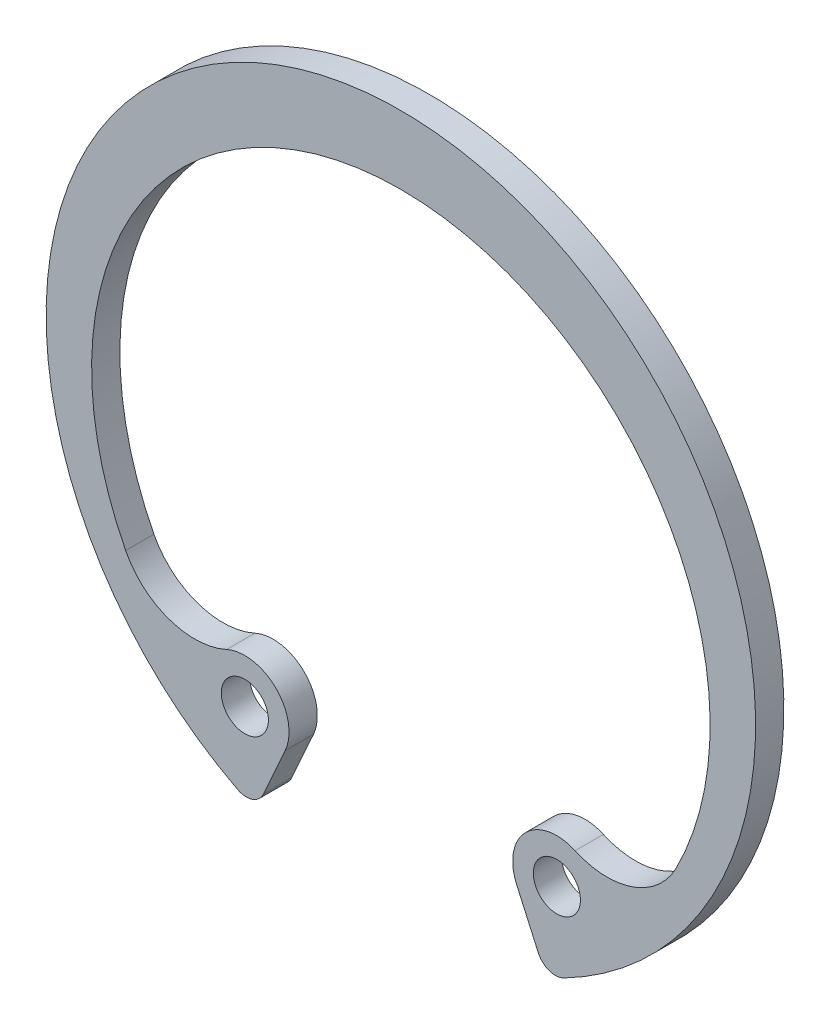
ISO-10303-21;
HEADER;
FILE_DESCRIPTION(('STEP AP214'),'2;1');
FILE_NAME('part.step','',(''),(''),'','','');
FILE_SCHEMA(('AUTOMOTIVE_DESIGN { 1 0 10303 214 1 1 1 1 }'));
ENDSEC;
DATA;
#1=APPLICATION_CONTEXT('core data for automotive mechanical design processes');
#2=APPLICATION_PROTOCOL_DEFINITION('international standard','automotive_design',2000,#1);
#3=PRODUCT_CONTEXT('',#1,'mechanical');
#4=PRODUCT('Part','Part','',(#3));
#5=PRODUCT_RELATED_PRODUCT_CATEGORY('part','',(#4));
#6=PRODUCT_DEFINITION_FORMATION('','',#4);
#7=PRODUCT_DEFINITION_CONTEXT('part definition',#1,'design');
#8=PRODUCT_DEFINITION('design','',#6,#7);
#9=PRODUCT_DEFINITION_SHAPE('','',#8);
#10=(LENGTH_UNIT() NAMED_UNIT(*) SI_UNIT(.MILLI.,.METRE.));
#11=(NAMED_UNIT(*) PLANE_ANGLE_UNIT() SI_UNIT($,.RADIAN.));
#12=(NAMED_UNIT(*) SI_UNIT($,.STERADIAN.) SOLID_ANGLE_UNIT());
#13=UNCERTAINTY_MEASURE_WITH_UNIT(LENGTH_MEASURE(1.E-05),#10,'distance_accuracy_value','');
#14=(GEOMETRIC_REPRESENTATION_CONTEXT(3) GLOBAL_UNCERTAINTY_ASSIGNED_CONTEXT((#13)) GLOBAL_UNIT_ASSIGNED_CONTEXT((#10,
#11,#12)) REPRESENTATION_CONTEXT('',''));
#15=CARTESIAN_POINT('',(0.,0.,0.));
#16=DIRECTION('',(0.,0.,1.));
#17=DIRECTION('',(1.,0.,0.));
#18=AXIS2_PLACEMENT_3D('',#15,#16,#17);
#19=CARTESIAN_POINT('',(0.,0.,-0.600000000000003));
#20=DIRECTION('',(0.,0.,1.));
#21=DIRECTION('',(1.,0.,0.));
#22=AXIS2_PLACEMENT_3D('',#19,#20,#21);
#23=CYLINDRICAL_SURFACE('',#22,15.05);
#24=CARTESIAN_POINT('',(0.,0.,0.600000000000003));
#25=DIRECTION('',(0.,0.,1.));
#26=DIRECTION('',(-1.,0.,0.));
#27=AXIS2_PLACEMENT_3D('',#24,#25,#26);
#28=CIRCLE('',#27,15.05);
#29=CARTESIAN_POINT('',(6.921631693515,-13.3638884573065,0.600000000000003));
#30=VERTEX_POINT('',#29);
#31=CARTESIAN_POINT('',(-6.92163169351501,-13.3638884573065,0.600000000000003));
#32=VERTEX_POINT('',#31);
#33=EDGE_CURVE('E134',#30,#32,#28,.T.);
#34=ORIENTED_EDGE('',*,*,#33,.F.);
#35=DIRECTION('',(0.,0.,1.));
#36=VECTOR('',#35,1.);
#37=CARTESIAN_POINT('',(6.92163169351501,-13.3638884573065,-0.600000000000003));
#38=LINE('',#37,#36);
#39=CARTESIAN_POINT('',(6.921631693515,-13.3638884573065,-0.600000000000003));
#40=VERTEX_POINT('',#39);
#41=EDGE_CURVE('E233',#30,#40,#38,.F.);
#42=ORIENTED_EDGE('',*,*,#41,.T.);
#43=CARTESIAN_POINT('',(0.,0.,-0.600000000000003));
#44=DIRECTION('',(0.,0.,1.));
#45=DIRECTION('',(-1.,0.,0.));
#46=AXIS2_PLACEMENT_3D('',#43,#44,#45);
#47=CIRCLE('',#46,15.05);
#48=CARTESIAN_POINT('',(-6.92163169351501,-13.3638884573065,-0.600000000000003));
#49=VERTEX_POINT('',#48);
#50=EDGE_CURVE('E179',#40,#49,#47,.T.);
#51=ORIENTED_EDGE('',*,*,#50,.T.);
#52=DIRECTION('',(0.,0.,1.));
#53=VECTOR('',#52,1.);
#54=CARTESIAN_POINT('',(-6.92163169351501,-13.3638884573065,-0.600000000000003));
#55=LINE('',#54,#53);
#56=EDGE_CURVE('E229',#49,#32,#55,.T.);
#57=ORIENTED_EDGE('',*,*,#56,.T.);
#58=EDGE_LOOP('',(#34,#42,#51,#57));
#59=FACE_BOUND('',#58,.T.);
#60=ADVANCED_FACE('F45',(#59),#23,.T.);
#61=CARTESIAN_POINT('',(4.90852916224253,-10.9273208730875,-0.600000000000003));
#62=DIRECTION('',(-0.912195121951219,-0.409756097560976,0.));
#63=DIRECTION('',(0.409756097560976,-0.912195121951219,0.));
#64=AXIS2_PLACEMENT_3D('',#61,#62,#63);
#65=PLANE('',#64);
#66=DIRECTION('',(0.409756097560976,-0.912195121951219,0.));
#67=VECTOR('',#66,1.);
#68=CARTESIAN_POINT('',(4.90852916224253,-10.9273208730875,-0.600000000000003));
#69=LINE('',#68,#67);
#70=CARTESIAN_POINT('',(4.90852916224253,-10.9273208730875,-0.600000000000003));
#71=VERTEX_POINT('',#70);
#72=CARTESIAN_POINT('',(5.83252398113217,-12.984309338949,-0.600000000000003));
#73=VERTEX_POINT('',#72);
#74=EDGE_CURVE('E145',#71,#73,#69,.T.);
#75=ORIENTED_EDGE('',*,*,#74,.T.);
#76=DIRECTION('',(0.,0.,1.));
#77=VECTOR('',#76,1.);
#78=CARTESIAN_POINT('',(5.83252398113217,-12.984309338949,-0.600000000000003));
#79=LINE('',#78,#77);
#80=CARTESIAN_POINT('',(5.83252398113217,-12.984309338949,0.600000000000003));
#81=VERTEX_POINT('',#80);
#82=EDGE_CURVE('E209',#73,#81,#79,.T.);
#83=ORIENTED_EDGE('',*,*,#82,.T.);
#84=DIRECTION('',(0.409756097560976,-0.912195121951219,0.));
#85=VECTOR('',#84,1.);
#86=CARTESIAN_POINT('',(4.90852916224253,-10.9273208730875,0.600000000000003));
#87=LINE('',#86,#85);
#88=CARTESIAN_POINT('',(4.90852916224253,-10.9273208730875,0.600000000000003));
#89=VERTEX_POINT('',#88);
#90=EDGE_CURVE('E168',#89,#81,#87,.T.);
#91=ORIENTED_EDGE('',*,*,#90,.F.);
#92=DIRECTION('',(0.,0.,1.));
#93=VECTOR('',#92,1.);
#94=CARTESIAN_POINT('',(4.90852916224253,-10.9273208730875,-0.600000000000003));
#95=LINE('',#94,#93);
#96=EDGE_CURVE('E206',#71,#89,#95,.T.);
#97=ORIENTED_EDGE('',*,*,#96,.F.);
#98=EDGE_LOOP('',(#75,#83,#91,#97));
#99=FACE_BOUND('',#98,.T.);
#100=ADVANCED_FACE('F247',(#99),#65,.T.);
#101=CARTESIAN_POINT('',(6.61889501590107,-10.1590281901607,-0.600000000000003));
#102=DIRECTION('',(0.,0.,1.));
#103=DIRECTION('',(1.,0.,0.));
#104=AXIS2_PLACEMENT_3D('',#101,#102,#103);
#105=CYLINDRICAL_SURFACE('',#104,1.875);
#106=ORIENTED_EDGE('',*,*,#96,.T.);
#107=CARTESIAN_POINT('',(6.61889501590107,-10.1590281901607,0.600000000000003));
#108=DIRECTION('',(0.,0.,1.));
#109=DIRECTION('',(1.,0.,0.));
#110=AXIS2_PLACEMENT_3D('',#107,#108,#109);
#111=CIRCLE('',#110,1.875);
#112=CARTESIAN_POINT('',(7.39299739421459,-8.45128391542596,0.600000000000003));
#113=VERTEX_POINT('',#112);
#114=EDGE_CURVE('E164',#113,#89,#111,.T.);
#115=ORIENTED_EDGE('',*,*,#114,.F.);
#116=DIRECTION('',(0.,0.,1.));
#117=VECTOR('',#116,1.);
#118=CARTESIAN_POINT('',(7.39299739421459,-8.45128391542596,-0.600000000000003));
#119=LINE('',#118,#117);
#120=CARTESIAN_POINT('',(7.39299739421459,-8.45128391542596,-0.600000000000003));
#121=VERTEX_POINT('',#120);
#122=EDGE_CURVE('E210',#121,#113,#119,.T.);
#123=ORIENTED_EDGE('',*,*,#122,.F.);
#124=CARTESIAN_POINT('',(6.61889501590107,-10.1590281901607,-0.600000000000003));
#125=DIRECTION('',(0.,0.,1.));
#126=DIRECTION('',(1.,0.,0.));
#127=AXIS2_PLACEMENT_3D('',#124,#125,#126);
#128=CIRCLE('',#127,1.875);
#129=EDGE_CURVE('E199',#121,#71,#128,.T.);
#130=ORIENTED_EDGE('',*,*,#129,.T.);
#131=EDGE_LOOP('',(#106,#115,#123,#130));
#132=FACE_BOUND('',#131,.T.);
#133=ADVANCED_FACE('F282',(#132),#105,.T.);
#134=CARTESIAN_POINT('',(8.75028885540433,-5.45696845156832,-0.600000000000003));
#135=DIRECTION('',(0.,0.,1.));
#136=DIRECTION('',(1.,0.,0.));
#137=AXIS2_PLACEMENT_3D('',#134,#135,#136);
#138=CYLINDRICAL_SURFACE('',#137,3.28757740710627);
#139=ORIENTED_EDGE('',*,*,#122,.T.);
#140=CARTESIAN_POINT('',(8.75028885540433,-5.45696845156832,0.600000000000003));
#141=DIRECTION('',(0.,0.,-1.));
#142=DIRECTION('',(-1.,0.,0.));
#143=AXIS2_PLACEMENT_3D('',#140,#141,#142);
#144=CIRCLE('',#143,3.28757740710627);
#145=CARTESIAN_POINT('',(11.6757947051064,-6.9568286887487,0.600000000000003));
#146=VERTEX_POINT('',#145);
#147=EDGE_CURVE('E160',#146,#113,#144,.T.);
#148=ORIENTED_EDGE('',*,*,#147,.F.);
#149=DIRECTION('',(0.,0.,1.));
#150=VECTOR('',#149,1.);
#151=CARTESIAN_POINT('',(11.6757947051064,-6.9568286887487,-0.600000000000003));
#152=LINE('',#151,#150);
#153=CARTESIAN_POINT('',(11.6757947051064,-6.9568286887487,-0.600000000000003));
#154=VERTEX_POINT('',#153);
#155=EDGE_CURVE('E213',#154,#146,#152,.T.);
#156=ORIENTED_EDGE('',*,*,#155,.F.);
#157=CARTESIAN_POINT('',(8.75028885540433,-5.45696845156832,-0.600000000000003));
#158=DIRECTION('',(0.,0.,-1.));
#159=DIRECTION('',(-1.,0.,0.));
#160=AXIS2_PLACEMENT_3D('',#157,#158,#159);
#161=CIRCLE('',#160,3.28757740710627);
#162=EDGE_CURVE('E195',#154,#121,#161,.T.);
#163=ORIENTED_EDGE('',*,*,#162,.T.);
#164=EDGE_LOOP('',(#139,#148,#156,#163));
#165=FACE_BOUND('',#164,.T.);
#166=ADVANCED_FACE('F296',(#165),#138,.F.);
#167=CARTESIAN_POINT('',(0.,-0.970834773387413,-0.600000000000003));
#168=DIRECTION('',(0.,0.,1.));
#169=DIRECTION('',(1.,0.,0.));
#170=AXIS2_PLACEMENT_3D('',#167,#168,#169);
#171=CYLINDRICAL_SURFACE('',#170,13.1208347733874);
#172=ORIENTED_EDGE('',*,*,#155,.T.);
#173=CARTESIAN_POINT('',(0.,-0.970834773387413,0.600000000000003));
#174=DIRECTION('',(0.,0.,-1.));
#175=DIRECTION('',(-1.,0.,0.));
#176=AXIS2_PLACEMENT_3D('',#173,#174,#175);
#177=CIRCLE('',#176,13.1208347733874);
#178=CARTESIAN_POINT('',(-11.6757947051064,-6.9568286887487,0.600000000000003));
#179=VERTEX_POINT('',#178);
#180=EDGE_CURVE('E153',#179,#146,#177,.T.);
#181=ORIENTED_EDGE('',*,*,#180,.F.);
#182=DIRECTION('',(0.,0.,1.));
#183=VECTOR('',#182,1.);
#184=CARTESIAN_POINT('',(-11.6757947051064,-6.9568286887487,-0.600000000000003));
#185=LINE('',#184,#183);
#186=CARTESIAN_POINT('',(-11.6757947051064,-6.9568286887487,-0.600000000000003));
#187=VERTEX_POINT('',#186);
#188=EDGE_CURVE('E216',#187,#179,#185,.T.);
#189=ORIENTED_EDGE('',*,*,#188,.F.);
#190=CARTESIAN_POINT('',(0.,-0.970834773387413,-0.600000000000003));
#191=DIRECTION('',(0.,0.,-1.));
#192=DIRECTION('',(-1.,0.,0.));
#193=AXIS2_PLACEMENT_3D('',#190,#191,#192);
#194=CIRCLE('',#193,13.1208347733874);
#195=EDGE_CURVE('E191',#187,#154,#194,.T.);
#196=ORIENTED_EDGE('',*,*,#195,.T.);
#197=EDGE_LOOP('',(#172,#181,#189,#196));
#198=FACE_BOUND('',#197,.T.);
#199=ADVANCED_FACE('F292',(#198),#171,.F.);
#200=CARTESIAN_POINT('',(-8.75028885540433,-5.45696845156832,-0.600000000000003));
#201=DIRECTION('',(0.,0.,1.));
#202=DIRECTION('',(1.,0.,0.));
#203=AXIS2_PLACEMENT_3D('',#200,#201,#202);
#204=CYLINDRICAL_SURFACE('',#203,3.28757740710627);
#205=ORIENTED_EDGE('',*,*,#188,.T.);
#206=CARTESIAN_POINT('',(-8.75028885540433,-5.45696845156832,0.600000000000003));
#207=DIRECTION('',(0.,0.,-1.));
#208=DIRECTION('',(1.,0.,0.));
#209=AXIS2_PLACEMENT_3D('',#206,#207,#208);
#210=CIRCLE('',#209,3.28757740710627);
#211=CARTESIAN_POINT('',(-7.39299739421459,-8.45128391542596,0.600000000000003));
#212=VERTEX_POINT('',#211);
#213=EDGE_CURVE('E149',#212,#179,#210,.T.);
#214=ORIENTED_EDGE('',*,*,#213,.F.);
#215=DIRECTION('',(0.,0.,1.));
#216=VECTOR('',#215,1.);
#217=CARTESIAN_POINT('',(-7.39299739421459,-8.45128391542596,-0.600000000000003));
#218=LINE('',#217,#216);
#219=CARTESIAN_POINT('',(-7.39299739421459,-8.45128391542596,-0.600000000000003));
#220=VERTEX_POINT('',#219);
#221=EDGE_CURVE('E144',#220,#212,#218,.T.);
#222=ORIENTED_EDGE('',*,*,#221,.F.);
#223=CARTESIAN_POINT('',(-8.75028885540433,-5.45696845156832,-0.600000000000003));
#224=DIRECTION('',(0.,0.,-1.));
#225=DIRECTION('',(1.,0.,0.));
#226=AXIS2_PLACEMENT_3D('',#223,#224,#225);
#227=CIRCLE('',#226,3.28757740710627);
#228=EDGE_CURVE('E187',#220,#187,#227,.T.);
#229=ORIENTED_EDGE('',*,*,#228,.T.);
#230=EDGE_LOOP('',(#205,#214,#222,#229));
#231=FACE_BOUND('',#230,.T.);
#232=ADVANCED_FACE('F289',(#231),#204,.F.);
#233=CARTESIAN_POINT('',(-6.61889501590107,-10.1590281901607,-0.600000000000003));
#234=DIRECTION('',(0.,0.,1.));
#235=DIRECTION('',(1.,0.,0.));
#236=AXIS2_PLACEMENT_3D('',#233,#234,#235);
#237=CYLINDRICAL_SURFACE('',#236,1.875);
#238=ORIENTED_EDGE('',*,*,#221,.T.);
#239=CARTESIAN_POINT('',(-6.61889501590107,-10.1590281901607,0.600000000000003));
#240=DIRECTION('',(0.,0.,1.));
#241=DIRECTION('',(-1.,0.,0.));
#242=AXIS2_PLACEMENT_3D('',#239,#240,#241);
#243=CIRCLE('',#242,1.875);
#244=CARTESIAN_POINT('',(-4.90852916224253,-10.9273208730875,0.600000000000003));
#245=VERTEX_POINT('',#244);
#246=EDGE_CURVE('E129',#245,#212,#243,.T.);
#247=ORIENTED_EDGE('',*,*,#246,.F.);
#248=DIRECTION('',(0.,0.,1.));
#249=VECTOR('',#248,1.);
#250=CARTESIAN_POINT('',(-4.90852916224253,-10.9273208730875,-0.600000000000003));
#251=LINE('',#250,#249);
#252=CARTESIAN_POINT('',(-4.90852916224253,-10.9273208730875,-0.600000000000003));
#253=VERTEX_POINT('',#252);
#254=EDGE_CURVE('E137',#253,#245,#251,.T.);
#255=ORIENTED_EDGE('',*,*,#254,.F.);
#256=CARTESIAN_POINT('',(-6.61889501590107,-10.1590281901607,-0.600000000000003));
#257=DIRECTION('',(0.,0.,1.));
#258=DIRECTION('',(-1.,0.,0.));
#259=AXIS2_PLACEMENT_3D('',#256,#257,#258);
#260=CIRCLE('',#259,1.875);
#261=EDGE_CURVE('E184',#253,#220,#260,.T.);
#262=ORIENTED_EDGE('',*,*,#261,.T.);
#263=EDGE_LOOP('',(#238,#247,#255,#262));
#264=FACE_BOUND('',#263,.T.);
#265=ADVANCED_FACE('F147',(#264),#237,.T.);
#266=CARTESIAN_POINT('',(-4.90852916224253,-10.9273208730875,-0.600000000000003));
#267=DIRECTION('',(0.912195121951219,-0.409756097560976,0.));
#268=DIRECTION('',(0.409756097560976,0.912195121951219,0.));
#269=AXIS2_PLACEMENT_3D('',#266,#267,#268);
#270=PLANE('',#269);
#271=DIRECTION('',(0.409756097560976,0.912195121951219,0.));
#272=VECTOR('',#271,1.);
#273=CARTESIAN_POINT('',(-4.90852916224253,-10.9273208730875,0.600000000000003));
#274=LINE('',#273,#272);
#275=CARTESIAN_POINT('',(-5.83252398113217,-12.984309338949,0.600000000000003));
#276=VERTEX_POINT('',#275);
#277=EDGE_CURVE('E122',#276,#245,#274,.T.);
#278=ORIENTED_EDGE('',*,*,#277,.F.);
#279=DIRECTION('',(0.,0.,1.));
#280=VECTOR('',#279,1.);
#281=CARTESIAN_POINT('',(-5.83252398113217,-12.984309338949,-0.600000000000003));
#282=LINE('',#281,#280);
#283=CARTESIAN_POINT('',(-5.83252398113217,-12.984309338949,-0.600000000000003));
#284=VERTEX_POINT('',#283);
#285=EDGE_CURVE('E11',#276,#284,#282,.F.);
#286=ORIENTED_EDGE('',*,*,#285,.T.);
#287=DIRECTION('',(0.409756097560976,0.912195121951219,0.));
#288=VECTOR('',#287,1.);
#289=CARTESIAN_POINT('',(-4.90852916224253,-10.9273208730875,-0.600000000000003));
#290=LINE('',#289,#288);
#291=EDGE_CURVE('E139',#284,#253,#290,.T.);
#292=ORIENTED_EDGE('',*,*,#291,.T.);
#293=ORIENTED_EDGE('',*,*,#254,.T.);
#294=EDGE_LOOP('',(#278,#286,#292,#293));
#295=FACE_BOUND('',#294,.T.);
#296=ADVANCED_FACE('F138',(#295),#270,.T.);
#297=CARTESIAN_POINT('',(0.,0.,-0.600000000000003));
#298=DIRECTION('',(0.,0.,-1.));
#299=DIRECTION('',(-1.,0.,0.));
#300=AXIS2_PLACEMENT_3D('',#297,#298,#299);
#301=PLANE('',#300);
#302=CARTESIAN_POINT('',(6.61889501590107,-10.1590281901607,-0.600000000000003));
#303=DIRECTION('',(0.,0.,1.));
#304=DIRECTION('',(-1.,0.,0.));
#305=AXIS2_PLACEMENT_3D('',#302,#303,#304);
#306=CIRCLE('',#305,1.);
#307=CARTESIAN_POINT('',(5.61889501590107,-10.1590281901607,-0.600000000000003));
#308=VERTEX_POINT('',#307);
#309=EDGE_CURVE('E171',#308,#308,#306,.T.);
#310=ORIENTED_EDGE('',*,*,#309,.T.);
#311=EDGE_LOOP('',(#310));
#312=FACE_BOUND('',#311,.T.);
#313=CARTESIAN_POINT('',(-6.61889501590107,-10.1590281901607,-0.600000000000003));
#314=DIRECTION('',(0.,0.,1.));
#315=DIRECTION('',(1.,0.,0.));
#316=AXIS2_PLACEMENT_3D('',#313,#314,#315);
#317=CIRCLE('',#316,1.);
#318=CARTESIAN_POINT('',(-5.61889501590107,-10.1590281901607,-0.600000000000003));
#319=VERTEX_POINT('',#318);
#320=EDGE_CURVE('E175',#319,#319,#317,.T.);
#321=ORIENTED_EDGE('',*,*,#320,.T.);
#322=EDGE_LOOP('',(#321));
#323=FACE_BOUND('',#322,.T.);
#324=ORIENTED_EDGE('',*,*,#50,.F.);
#325=CARTESIAN_POINT('',(6.55657885918095,-12.65906543651,-0.600000000000003));
#326=DIRECTION('',(0.,0.,-1.));
#327=DIRECTION('',(-1.,0.,0.));
#328=AXIS2_PLACEMENT_3D('',#325,#326,#327);
#329=CIRCLE('',#328,0.79375);
#330=EDGE_CURVE('E54',#40,#73,#329,.T.);
#331=ORIENTED_EDGE('',*,*,#330,.T.);
#332=ORIENTED_EDGE('',*,*,#74,.F.);
#333=ORIENTED_EDGE('',*,*,#129,.F.);
#334=ORIENTED_EDGE('',*,*,#162,.F.);
#335=ORIENTED_EDGE('',*,*,#195,.F.);
#336=ORIENTED_EDGE('',*,*,#228,.F.);
#337=ORIENTED_EDGE('',*,*,#261,.F.);
#338=ORIENTED_EDGE('',*,*,#291,.F.);
#339=CARTESIAN_POINT('',(-6.55657885918095,-12.65906543651,-0.600000000000003));
#340=DIRECTION('',(0.,0.,-1.));
#341=DIRECTION('',(-1.,0.,0.));
#342=AXIS2_PLACEMENT_3D('',#339,#340,#341);
#343=CIRCLE('',#342,0.79375);
#344=EDGE_CURVE('E66',#284,#49,#343,.T.);
#345=ORIENTED_EDGE('',*,*,#344,.T.);
#346=EDGE_LOOP('',(#324,#331,#332,#333,#334,#335,#336,#337,#338,#345));
#347=FACE_BOUND('',#346,.T.);
#348=ADVANCED_FACE('F241',(#312,#323,#347),#301,.T.);
#349=CARTESIAN_POINT('',(-6.61889501590107,-10.1590281901607,-0.600000000000003));
#350=DIRECTION('',(0.,0.,1.));
#351=DIRECTION('',(1.,0.,0.));
#352=AXIS2_PLACEMENT_3D('',#349,#350,#351);
#353=CYLINDRICAL_SURFACE('',#352,1.);
#354=ORIENTED_EDGE('',*,*,#320,.F.);
#355=EDGE_LOOP('',(#354));
#356=FACE_BOUND('',#355,.T.);
#357=CARTESIAN_POINT('',(-6.61889501590107,-10.1590281901607,0.600000000000003));
#358=DIRECTION('',(0.,0.,1.));
#359=DIRECTION('',(1.,0.,0.));
#360=AXIS2_PLACEMENT_3D('',#357,#358,#359);
#361=CIRCLE('',#360,1.);
#362=CARTESIAN_POINT('',(-5.61889501590107,-10.1590281901607,0.600000000000003));
#363=VERTEX_POINT('',#362);
#364=EDGE_CURVE('E254',#363,#363,#361,.T.);
#365=ORIENTED_EDGE('',*,*,#364,.T.);
#366=EDGE_LOOP('',(#365));
#367=FACE_BOUND('',#366,.T.);
#368=ADVANCED_FACE('F274',(#356,#367),#353,.F.);
#369=CARTESIAN_POINT('',(6.61889501590107,-10.1590281901607,-0.600000000000003));
#370=DIRECTION('',(0.,0.,1.));
#371=DIRECTION('',(1.,0.,0.));
#372=AXIS2_PLACEMENT_3D('',#369,#370,#371);
#373=CYLINDRICAL_SURFACE('',#372,1.);
#374=ORIENTED_EDGE('',*,*,#309,.F.);
#375=EDGE_LOOP('',(#374));
#376=FACE_BOUND('',#375,.T.);
#377=CARTESIAN_POINT('',(6.61889501590107,-10.1590281901607,0.600000000000003));
#378=DIRECTION('',(0.,0.,1.));
#379=DIRECTION('',(-1.,0.,0.));
#380=AXIS2_PLACEMENT_3D('',#377,#378,#379);
#381=CIRCLE('',#380,1.);
#382=CARTESIAN_POINT('',(5.61889501590107,-10.1590281901607,0.600000000000003));
#383=VERTEX_POINT('',#382);
#384=EDGE_CURVE('E258',#383,#383,#381,.T.);
#385=ORIENTED_EDGE('',*,*,#384,.T.);
#386=EDGE_LOOP('',(#385));
#387=FACE_BOUND('',#386,.T.);
#388=ADVANCED_FACE('F266',(#376,#387),#373,.F.);
#389=CARTESIAN_POINT('',(0.,0.,0.600000000000003));
#390=DIRECTION('',(0.,0.,-1.));
#391=DIRECTION('',(-1.,0.,0.));
#392=AXIS2_PLACEMENT_3D('',#389,#390,#391);
#393=PLANE('',#392);
#394=ORIENTED_EDGE('',*,*,#90,.T.);
#395=CARTESIAN_POINT('',(6.55657885918095,-12.65906543651,0.600000000000003));
#396=DIRECTION('',(0.,0.,-1.));
#397=DIRECTION('',(-1.,0.,0.));
#398=AXIS2_PLACEMENT_3D('',#395,#396,#397);
#399=CIRCLE('',#398,0.79375);
#400=EDGE_CURVE('E226',#81,#30,#399,.F.);
#401=ORIENTED_EDGE('',*,*,#400,.T.);
#402=ORIENTED_EDGE('',*,*,#33,.T.);
#403=CARTESIAN_POINT('',(-6.55657885918095,-12.65906543651,0.600000000000003));
#404=DIRECTION('',(0.,0.,-1.));
#405=DIRECTION('',(-1.,0.,0.));
#406=AXIS2_PLACEMENT_3D('',#403,#404,#405);
#407=CIRCLE('',#406,0.79375);
#408=EDGE_CURVE('E132',#32,#276,#407,.F.);
#409=ORIENTED_EDGE('',*,*,#408,.T.);
#410=ORIENTED_EDGE('',*,*,#277,.T.);
#411=ORIENTED_EDGE('',*,*,#246,.T.);
#412=ORIENTED_EDGE('',*,*,#213,.T.);
#413=ORIENTED_EDGE('',*,*,#180,.T.);
#414=ORIENTED_EDGE('',*,*,#147,.T.);
#415=ORIENTED_EDGE('',*,*,#114,.T.);
#416=EDGE_LOOP('',(#394,#401,#402,#409,#410,#411,#412,#413,#414,#415));
#417=FACE_BOUND('',#416,.T.);
#418=ORIENTED_EDGE('',*,*,#364,.F.);
#419=EDGE_LOOP('',(#418));
#420=FACE_BOUND('',#419,.T.);
#421=ORIENTED_EDGE('',*,*,#384,.F.);
#422=EDGE_LOOP('',(#421));
#423=FACE_BOUND('',#422,.T.);
#424=ADVANCED_FACE('F125',(#417,#420,#423),#393,.F.);
#425=CARTESIAN_POINT('',(6.55657885918095,-12.65906543651,-0.600000000000003));
#426=DIRECTION('',(0.,0.,1.));
#427=DIRECTION('',(1.,0.,0.));
#428=AXIS2_PLACEMENT_3D('',#425,#426,#427);
#429=CYLINDRICAL_SURFACE('',#428,0.79375);
#430=ORIENTED_EDGE('',*,*,#330,.F.);
#431=ORIENTED_EDGE('',*,*,#41,.F.);
#432=ORIENTED_EDGE('',*,*,#400,.F.);
#433=ORIENTED_EDGE('',*,*,#82,.F.);
#434=EDGE_LOOP('',(#430,#431,#432,#433));
#435=FACE_BOUND('',#434,.T.);
#436=ADVANCED_FACE('F249',(#435),#429,.T.);
#437=CARTESIAN_POINT('',(-6.55657885918095,-12.65906543651,-0.600000000000003));
#438=DIRECTION('',(0.,0.,1.));
#439=DIRECTION('',(1.,0.,0.));
#440=AXIS2_PLACEMENT_3D('',#437,#438,#439);
#441=CYLINDRICAL_SURFACE('',#440,0.79375);
#442=ORIENTED_EDGE('',*,*,#344,.F.);
#443=ORIENTED_EDGE('',*,*,#285,.F.);
#444=ORIENTED_EDGE('',*,*,#408,.F.);
#445=ORIENTED_EDGE('',*,*,#56,.F.);
#446=EDGE_LOOP('',(#442,#443,#444,#445));
#447=FACE_BOUND('',#446,.T.);
#448=ADVANCED_FACE('F47',(#447),#441,.T.);
#449=CLOSED_SHELL('',(#60,#100,#133,#166,#199,#232,#265,#296,#348,#368,#388,#424,#436,#448));
#450=MANIFOLD_SOLID_BREP('B2',#449);
#451=ADVANCED_BREP_SHAPE_REPRESENTATION('',(#18,#450),#14);
#452=SHAPE_DEFINITION_REPRESENTATION(#9,#451);
ENDSEC;
END-ISO-10303-21;
